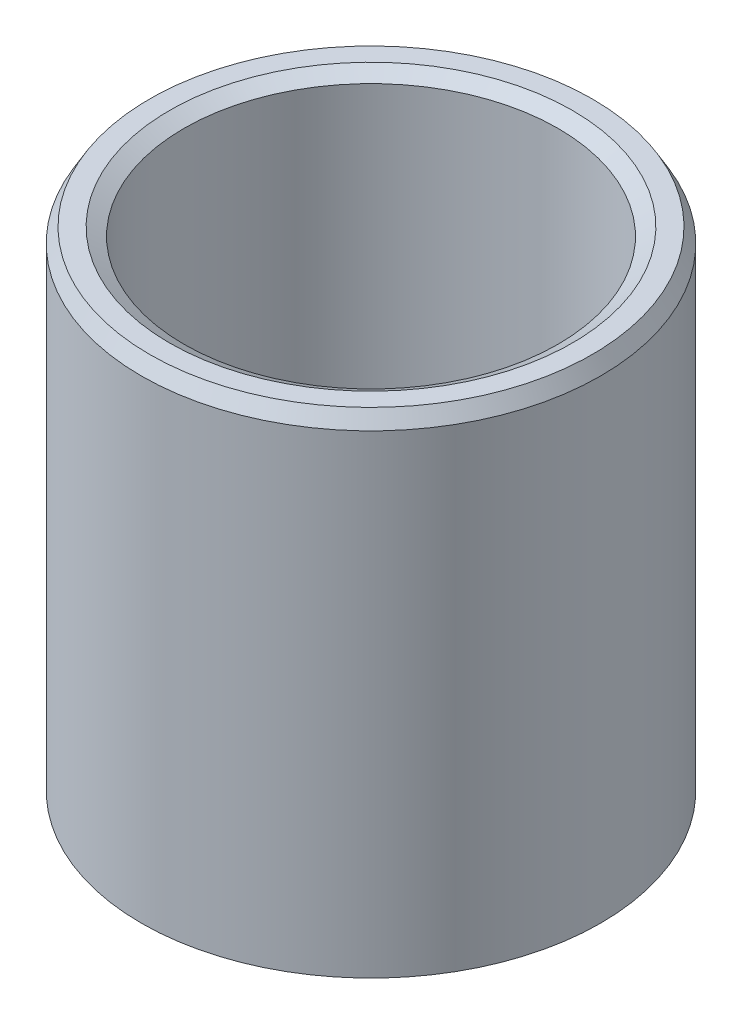
ISO-10303-21;
HEADER;
FILE_DESCRIPTION(('STEP AP214'),'2;1');
FILE_NAME('part.step','',(''),(''),'','','');
FILE_SCHEMA(('AUTOMOTIVE_DESIGN { 1 0 10303 214 1 1 1 1 }'));
ENDSEC;
DATA;
#1=APPLICATION_CONTEXT('core data for automotive mechanical design processes');
#2=APPLICATION_PROTOCOL_DEFINITION('international standard','automotive_design',2000,#1);
#3=PRODUCT_CONTEXT('',#1,'mechanical');
#4=PRODUCT('Part','Part','',(#3));
#5=PRODUCT_RELATED_PRODUCT_CATEGORY('part','',(#4));
#6=PRODUCT_DEFINITION_FORMATION('','',#4);
#7=PRODUCT_DEFINITION_CONTEXT('part definition',#1,'design');
#8=PRODUCT_DEFINITION('design','',#6,#7);
#9=PRODUCT_DEFINITION_SHAPE('','',#8);
#10=(LENGTH_UNIT() NAMED_UNIT(*) SI_UNIT(.MILLI.,.METRE.));
#11=(NAMED_UNIT(*) PLANE_ANGLE_UNIT() SI_UNIT($,.RADIAN.));
#12=(NAMED_UNIT(*) SI_UNIT($,.STERADIAN.) SOLID_ANGLE_UNIT());
#13=UNCERTAINTY_MEASURE_WITH_UNIT(LENGTH_MEASURE(1.E-05),#10,'distance_accuracy_value','');
#14=(GEOMETRIC_REPRESENTATION_CONTEXT(3) GLOBAL_UNCERTAINTY_ASSIGNED_CONTEXT((#13)) GLOBAL_UNIT_ASSIGNED_CONTEXT((#10,
#11,#12)) REPRESENTATION_CONTEXT('',''));
#15=CARTESIAN_POINT('',(0.,0.,0.));
#16=DIRECTION('',(0.,0.,1.));
#17=DIRECTION('',(1.,0.,0.));
#18=AXIS2_PLACEMENT_3D('',#15,#16,#17);
#19=CARTESIAN_POINT('',(0.,48.657604048547,0.));
#20=DIRECTION('',(0.,-1.,0.));
#21=DIRECTION('',(0.,0.,-1.));
#22=AXIS2_PLACEMENT_3D('',#19,#20,#21);
#23=CYLINDRICAL_SURFACE('',#22,22.5);
#24=CARTESIAN_POINT('',(0.,0.816046418271099,0.));
#25=DIRECTION('',(0.,1.,0.));
#26=DIRECTION('',(0.,0.,1.));
#27=AXIS2_PLACEMENT_3D('',#24,#25,#26);
#28=CIRCLE('',#27,22.5);
#29=CARTESIAN_POINT('',(0.,0.816046418271099,22.5));
#30=VERTEX_POINT('',#29);
#31=EDGE_CURVE('E10',#30,#30,#28,.T.);
#32=ORIENTED_EDGE('',*,*,#31,.T.);
#33=EDGE_LOOP('',(#32));
#34=FACE_BOUND('',#33,.T.);
#35=CARTESIAN_POINT('',(0.,47.2441701907668,0.));
#36=DIRECTION('',(0.,1.,0.));
#37=DIRECTION('',(0.,0.,1.));
#38=AXIS2_PLACEMENT_3D('',#35,#36,#37);
#39=CIRCLE('',#38,22.5);
#40=CARTESIAN_POINT('',(0.,47.2441701907668,22.5));
#41=VERTEX_POINT('',#40);
#42=EDGE_CURVE('E50',#41,#41,#39,.F.);
#43=ORIENTED_EDGE('',*,*,#42,.T.);
#44=EDGE_LOOP('',(#43));
#45=FACE_BOUND('',#44,.T.);
#46=ADVANCED_FACE('F39',(#34,#45),#23,.T.);
#47=CARTESIAN_POINT('',(0.,48.657604048547,0.));
#48=DIRECTION('',(0.,1.,0.));
#49=DIRECTION('',(0.,0.,1.));
#50=AXIS2_PLACEMENT_3D('',#47,#48,#49);
#51=PLANE('',#50);
#52=CARTESIAN_POINT('',(0.,48.657604048547,0.));
#53=DIRECTION('',(0.,1.,0.));
#54=DIRECTION('',(0.,0.,1.));
#55=AXIS2_PLACEMENT_3D('',#52,#53,#54);
#56=CIRCLE('',#55,19.735464405678);
#57=CARTESIAN_POINT('',(0.,48.657604048547,19.735464405678));
#58=VERTEX_POINT('',#57);
#59=EDGE_CURVE('E58',#58,#58,#56,.F.);
#60=ORIENTED_EDGE('',*,*,#59,.T.);
#61=EDGE_LOOP('',(#60));
#62=FACE_BOUND('',#61,.T.);
#63=CARTESIAN_POINT('',(0.,48.657604048547,0.));
#64=DIRECTION('',(0.,1.,0.));
#65=DIRECTION('',(0.,0.,1.));
#66=AXIS2_PLACEMENT_3D('',#63,#64,#65);
#67=CIRCLE('',#66,21.6839535817289);
#68=CARTESIAN_POINT('',(0.,48.657604048547,21.6839535817289));
#69=VERTEX_POINT('',#68);
#70=EDGE_CURVE('E61',#69,#69,#67,.T.);
#71=ORIENTED_EDGE('',*,*,#70,.T.);
#72=EDGE_LOOP('',(#71));
#73=FACE_BOUND('',#72,.T.);
#74=ADVANCED_FACE('F88',(#62,#73),#51,.T.);
#75=CARTESIAN_POINT('',(0.,0.,0.));
#76=DIRECTION('',(0.,1.,0.));
#77=DIRECTION('',(0.,0.,1.));
#78=AXIS2_PLACEMENT_3D('',#75,#76,#77);
#79=PLANE('',#78);
#80=CARTESIAN_POINT('',(0.,0.,0.));
#81=DIRECTION('',(0.,1.,0.));
#82=DIRECTION('',(0.,0.,1.));
#83=AXIS2_PLACEMENT_3D('',#80,#81,#82);
#84=CIRCLE('',#83,19.1380769661689);
#85=CARTESIAN_POINT('',(0.,0.,19.1380769661689));
#86=VERTEX_POINT('',#85);
#87=EDGE_CURVE('E51',#86,#86,#84,.T.);
#88=ORIENTED_EDGE('',*,*,#87,.T.);
#89=EDGE_LOOP('',(#88));
#90=FACE_BOUND('',#89,.T.);
#91=CARTESIAN_POINT('',(0.,0.,0.));
#92=DIRECTION('',(0.,1.,0.));
#93=DIRECTION('',(0.,0.,1.));
#94=AXIS2_PLACEMENT_3D('',#91,#92,#93);
#95=CIRCLE('',#94,21.0865661422198);
#96=CARTESIAN_POINT('',(0.,0.,21.0865661422198));
#97=VERTEX_POINT('',#96);
#98=EDGE_CURVE('E54',#97,#97,#95,.F.);
#99=ORIENTED_EDGE('',*,*,#98,.T.);
#100=EDGE_LOOP('',(#99));
#101=FACE_BOUND('',#100,.T.);
#102=ADVANCED_FACE('F83',(#90,#101),#79,.F.);
#103=CARTESIAN_POINT('',(0.,48.657604048547,0.));
#104=DIRECTION('',(0.,-1.,0.));
#105=DIRECTION('',(0.,0.,-1.));
#106=AXIS2_PLACEMENT_3D('',#103,#104,#105);
#107=CYLINDRICAL_SURFACE('',#106,18.3220305478978);
#108=CARTESIAN_POINT('',(0.,47.8415576302759,0.));
#109=DIRECTION('',(0.,1.,0.));
#110=DIRECTION('',(0.,0.,1.));
#111=AXIS2_PLACEMENT_3D('',#108,#109,#110);
#112=CIRCLE('',#111,18.3220305478978);
#113=CARTESIAN_POINT('',(0.,47.8415576302759,18.3220305478978));
#114=VERTEX_POINT('',#113);
#115=EDGE_CURVE('E67',#114,#114,#112,.T.);
#116=ORIENTED_EDGE('',*,*,#115,.T.);
#117=EDGE_LOOP('',(#116));
#118=FACE_BOUND('',#117,.T.);
#119=CARTESIAN_POINT('',(0.,1.41343385778016,0.));
#120=DIRECTION('',(0.,1.,0.));
#121=DIRECTION('',(0.,0.,1.));
#122=AXIS2_PLACEMENT_3D('',#119,#120,#121);
#123=CIRCLE('',#122,18.3220305478978);
#124=CARTESIAN_POINT('',(0.,1.41343385778016,18.3220305478978));
#125=VERTEX_POINT('',#124);
#126=EDGE_CURVE('E69',#125,#125,#123,.F.);
#127=ORIENTED_EDGE('',*,*,#126,.T.);
#128=EDGE_LOOP('',(#127));
#129=FACE_BOUND('',#128,.T.);
#130=ADVANCED_FACE('F71',(#118,#129),#107,.F.);
#131=CARTESIAN_POINT('',(0.,47.8415576302759,0.));
#132=DIRECTION('',(0.,1.,0.));
#133=DIRECTION('',(0.,0.,1.));
#134=AXIS2_PLACEMENT_3D('',#131,#132,#133);
#135=CONICAL_SURFACE('',#134,18.3220305478978,1.04719755119661);
#136=ORIENTED_EDGE('',*,*,#59,.F.);
#137=EDGE_LOOP('',(#136));
#138=FACE_BOUND('',#137,.T.);
#139=ORIENTED_EDGE('',*,*,#115,.F.);
#140=EDGE_LOOP('',(#139));
#141=FACE_BOUND('',#140,.T.);
#142=ADVANCED_FACE('F77',(#138,#141),#135,.F.);
#143=CARTESIAN_POINT('',(0.,0.,0.));
#144=DIRECTION('',(0.,-1.,0.));
#145=DIRECTION('',(0.,0.,-1.));
#146=AXIS2_PLACEMENT_3D('',#143,#144,#145);
#147=CONICAL_SURFACE('',#146,19.1380769661689,0.523598775598295);
#148=ORIENTED_EDGE('',*,*,#126,.F.);
#149=EDGE_LOOP('',(#148));
#150=FACE_BOUND('',#149,.T.);
#151=ORIENTED_EDGE('',*,*,#87,.F.);
#152=EDGE_LOOP('',(#151));
#153=FACE_BOUND('',#152,.T.);
#154=ADVANCED_FACE('F73',(#150,#153),#147,.F.);
#155=CARTESIAN_POINT('',(0.,0.816046418271099,0.));
#156=DIRECTION('',(0.,1.,0.));
#157=DIRECTION('',(0.,0.,1.));
#158=AXIS2_PLACEMENT_3D('',#155,#156,#157);
#159=CONICAL_SURFACE('',#158,22.5,1.0471975511966);
#160=ORIENTED_EDGE('',*,*,#98,.F.);
#161=EDGE_LOOP('',(#160));
#162=FACE_BOUND('',#161,.T.);
#163=ORIENTED_EDGE('',*,*,#31,.F.);
#164=EDGE_LOOP('',(#163));
#165=FACE_BOUND('',#164,.T.);
#166=ADVANCED_FACE('F76',(#162,#165),#159,.T.);
#167=CARTESIAN_POINT('',(0.,48.657604048547,0.));
#168=DIRECTION('',(0.,-1.,0.));
#169=DIRECTION('',(0.,0.,-1.));
#170=AXIS2_PLACEMENT_3D('',#167,#168,#169);
#171=CONICAL_SURFACE('',#170,21.6839535817289,0.523598775598297);
#172=ORIENTED_EDGE('',*,*,#42,.F.);
#173=EDGE_LOOP('',(#172));
#174=FACE_BOUND('',#173,.T.);
#175=ORIENTED_EDGE('',*,*,#70,.F.);
#176=EDGE_LOOP('',(#175));
#177=FACE_BOUND('',#176,.T.);
#178=ADVANCED_FACE('F45',(#174,#177),#171,.T.);
#179=CLOSED_SHELL('',(#46,#74,#102,#130,#142,#154,#166,#178));
#180=MANIFOLD_SOLID_BREP('B2',#179);
#181=ADVANCED_BREP_SHAPE_REPRESENTATION('',(#18,#180),#14);
#182=SHAPE_DEFINITION_REPRESENTATION(#9,#181);
ENDSEC;
END-ISO-10303-21;
